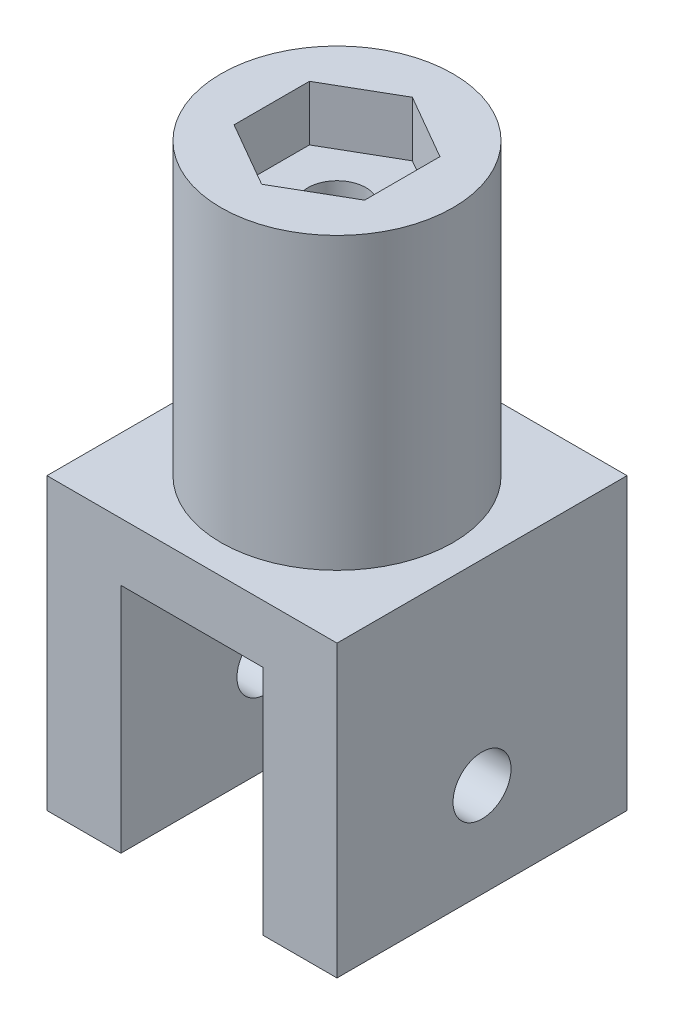
ISO-10303-21;
HEADER;
FILE_DESCRIPTION(('STEP AP214'),'2;1');
FILE_NAME('part.step','',(''),(''),'','','');
FILE_SCHEMA(('AUTOMOTIVE_DESIGN { 1 0 10303 214 1 1 1 1 }'));
ENDSEC;
DATA;
#1=APPLICATION_CONTEXT('core data for automotive mechanical design processes');
#2=APPLICATION_PROTOCOL_DEFINITION('international standard','automotive_design',2000,#1);
#3=PRODUCT_CONTEXT('',#1,'mechanical');
#4=PRODUCT('Part','Part','',(#3));
#5=PRODUCT_RELATED_PRODUCT_CATEGORY('part','',(#4));
#6=PRODUCT_DEFINITION_FORMATION('','',#4);
#7=PRODUCT_DEFINITION_CONTEXT('part definition',#1,'design');
#8=PRODUCT_DEFINITION('design','',#6,#7);
#9=PRODUCT_DEFINITION_SHAPE('','',#8);
#10=(LENGTH_UNIT() NAMED_UNIT(*) SI_UNIT(.MILLI.,.METRE.));
#11=(NAMED_UNIT(*) PLANE_ANGLE_UNIT() SI_UNIT($,.RADIAN.));
#12=(NAMED_UNIT(*) SI_UNIT($,.STERADIAN.) SOLID_ANGLE_UNIT());
#13=UNCERTAINTY_MEASURE_WITH_UNIT(LENGTH_MEASURE(1.E-05),#10,'distance_accuracy_value','');
#14=(GEOMETRIC_REPRESENTATION_CONTEXT(3) GLOBAL_UNCERTAINTY_ASSIGNED_CONTEXT((#13)) GLOBAL_UNIT_ASSIGNED_CONTEXT((#10,
#11,#12)) REPRESENTATION_CONTEXT('',''));
#15=CARTESIAN_POINT('',(0.,0.,0.));
#16=DIRECTION('',(0.,0.,1.));
#17=DIRECTION('',(1.,0.,0.));
#18=AXIS2_PLACEMENT_3D('',#15,#16,#17);
#19=CARTESIAN_POINT('',(0.,20.,0.));
#20=DIRECTION('',(0.,1.,0.));
#21=DIRECTION('',(0.,0.,1.));
#22=AXIS2_PLACEMENT_3D('',#19,#20,#21);
#23=PLANE('',#22);
#24=DIRECTION('',(0.,0.,-1.));
#25=VECTOR('',#24,1.);
#26=CARTESIAN_POINT('',(4.5,20.,2.59807621135332));
#27=LINE('',#26,#25);
#28=CARTESIAN_POINT('',(4.5,20.,2.59807621135332));
#29=VERTEX_POINT('',#28);
#30=CARTESIAN_POINT('',(4.5,20.,-2.59807621135332));
#31=VERTEX_POINT('',#30);
#32=EDGE_CURVE('E48',#29,#31,#27,.T.);
#33=ORIENTED_EDGE('',*,*,#32,.F.);
#34=DIRECTION('',(0.866025403784439,0.,-0.5));
#35=VECTOR('',#34,1.);
#36=CARTESIAN_POINT('',(0.,20.,5.19615242270663));
#37=LINE('',#36,#35);
#38=CARTESIAN_POINT('',(0.,20.,5.19615242270663));
#39=VERTEX_POINT('',#38);
#40=EDGE_CURVE('E156',#39,#29,#37,.T.);
#41=ORIENTED_EDGE('',*,*,#40,.F.);
#42=DIRECTION('',(0.866025403784439,0.,0.5));
#43=VECTOR('',#42,1.);
#44=CARTESIAN_POINT('',(-4.5,20.,2.59807621135332));
#45=LINE('',#44,#43);
#46=CARTESIAN_POINT('',(-4.5,20.,2.59807621135332));
#47=VERTEX_POINT('',#46);
#48=EDGE_CURVE('E159',#47,#39,#45,.T.);
#49=ORIENTED_EDGE('',*,*,#48,.F.);
#50=DIRECTION('',(0.,0.,1.));
#51=VECTOR('',#50,1.);
#52=CARTESIAN_POINT('',(-4.5,20.,-2.59807621135332));
#53=LINE('',#52,#51);
#54=CARTESIAN_POINT('',(-4.5,20.,-2.59807621135332));
#55=VERTEX_POINT('',#54);
#56=EDGE_CURVE('E175',#55,#47,#53,.T.);
#57=ORIENTED_EDGE('',*,*,#56,.F.);
#58=DIRECTION('',(-0.866025403784439,0.,0.5));
#59=VECTOR('',#58,1.);
#60=CARTESIAN_POINT('',(0.,20.,-5.19615242270663));
#61=LINE('',#60,#59);
#62=CARTESIAN_POINT('',(0.,20.,-5.19615242270663));
#63=VERTEX_POINT('',#62);
#64=EDGE_CURVE('E172',#63,#55,#61,.T.);
#65=ORIENTED_EDGE('',*,*,#64,.F.);
#66=DIRECTION('',(-0.866025403784439,0.,-0.5));
#67=VECTOR('',#66,1.);
#68=CARTESIAN_POINT('',(4.5,20.,-2.59807621135332));
#69=LINE('',#68,#67);
#70=EDGE_CURVE('E170',#31,#63,#69,.T.);
#71=ORIENTED_EDGE('',*,*,#70,.F.);
#72=EDGE_LOOP('',(#33,#41,#49,#57,#65,#71));
#73=FACE_BOUND('',#72,.T.);
#74=CARTESIAN_POINT('',(0.,20.,0.));
#75=DIRECTION('',(0.,1.,0.));
#76=DIRECTION('',(0.,0.,1.));
#77=AXIS2_PLACEMENT_3D('',#74,#75,#76);
#78=CIRCLE('',#77,8.);
#79=CARTESIAN_POINT('',(0.,20.,8.));
#80=VERTEX_POINT('',#79);
#81=EDGE_CURVE('E189',#80,#80,#78,.T.);
#82=ORIENTED_EDGE('',*,*,#81,.T.);
#83=EDGE_LOOP('',(#82));
#84=FACE_BOUND('',#83,.T.);
#85=ADVANCED_FACE('F33',(#73,#84),#23,.T.);
#86=CARTESIAN_POINT('',(0.,42.6274169979695,0.));
#87=DIRECTION('',(0.,-1.,0.));
#88=DIRECTION('',(0.,0.,-1.));
#89=AXIS2_PLACEMENT_3D('',#86,#87,#88);
#90=CYLINDRICAL_SURFACE('',#89,8.);
#91=CARTESIAN_POINT('',(0.,0.,0.));
#92=DIRECTION('',(0.,-1.,0.));
#93=DIRECTION('',(0.,0.,-1.));
#94=AXIS2_PLACEMENT_3D('',#91,#92,#93);
#95=CIRCLE('',#94,8.);
#96=CARTESIAN_POINT('',(0.,0.,-8.));
#97=VERTEX_POINT('',#96);
#98=EDGE_CURVE('E11',#97,#97,#95,.F.);
#99=ORIENTED_EDGE('',*,*,#98,.T.);
#100=EDGE_LOOP('',(#99));
#101=FACE_BOUND('',#100,.T.);
#102=ORIENTED_EDGE('',*,*,#81,.F.);
#103=EDGE_LOOP('',(#102));
#104=FACE_BOUND('',#103,.T.);
#105=ADVANCED_FACE('F296',(#101,#104),#90,.T.);
#106=CARTESIAN_POINT('',(-10.,-13.5,0.));
#107=DIRECTION('',(1.,0.,0.));
#108=DIRECTION('',(0.,0.,-1.));
#109=AXIS2_PLACEMENT_3D('',#106,#107,#108);
#110=CYLINDRICAL_SURFACE('',#109,2.);
#111=CARTESIAN_POINT('',(-4.9,-13.5,0.));
#112=DIRECTION('',(1.,0.,0.));
#113=DIRECTION('',(0.,0.,-1.));
#114=AXIS2_PLACEMENT_3D('',#111,#112,#113);
#115=CIRCLE('',#114,2.);
#116=CARTESIAN_POINT('',(-4.9,-13.5,-2.));
#117=VERTEX_POINT('',#116);
#118=EDGE_CURVE('E196',#117,#117,#115,.T.);
#119=ORIENTED_EDGE('',*,*,#118,.T.);
#120=EDGE_LOOP('',(#119));
#121=FACE_BOUND('',#120,.T.);
#122=CARTESIAN_POINT('',(-10.,-13.5,0.));
#123=DIRECTION('',(1.,0.,0.));
#124=DIRECTION('',(0.,0.,-1.));
#125=AXIS2_PLACEMENT_3D('',#122,#123,#124);
#126=CIRCLE('',#125,2.);
#127=CARTESIAN_POINT('',(-10.,-13.5,-2.));
#128=VERTEX_POINT('',#127);
#129=EDGE_CURVE('E193',#128,#128,#126,.T.);
#130=ORIENTED_EDGE('',*,*,#129,.F.);
#131=EDGE_LOOP('',(#130));
#132=FACE_BOUND('',#131,.T.);
#133=ADVANCED_FACE('F267',(#121,#132),#110,.F.);
#134=CARTESIAN_POINT('',(4.9,0.,-30.6400096899202));
#135=DIRECTION('',(-1.,0.,0.));
#136=DIRECTION('',(0.,0.,1.));
#137=AXIS2_PLACEMENT_3D('',#134,#135,#136);
#138=PLANE('',#137);
#139=CARTESIAN_POINT('',(4.9,-13.5,0.));
#140=DIRECTION('',(-1.,0.,0.));
#141=DIRECTION('',(0.,0.,1.));
#142=AXIS2_PLACEMENT_3D('',#139,#140,#141);
#143=CIRCLE('',#142,2.);
#144=CARTESIAN_POINT('',(4.9,-13.5,2.));
#145=VERTEX_POINT('',#144);
#146=EDGE_CURVE('E199',#145,#145,#143,.T.);
#147=ORIENTED_EDGE('',*,*,#146,.F.);
#148=EDGE_LOOP('',(#147));
#149=FACE_BOUND('',#148,.T.);
#150=DIRECTION('',(0.,-1.,0.));
#151=VECTOR('',#150,1.);
#152=CARTESIAN_POINT('',(4.9,0.,10.));
#153=LINE('',#152,#151);
#154=CARTESIAN_POINT('',(4.9,-4.,10.));
#155=VERTEX_POINT('',#154);
#156=CARTESIAN_POINT('',(4.9,-20.,10.));
#157=VERTEX_POINT('',#156);
#158=EDGE_CURVE('E220',#155,#157,#153,.T.);
#159=ORIENTED_EDGE('',*,*,#158,.F.);
#160=DIRECTION('',(0.,0.,-1.));
#161=VECTOR('',#160,1.);
#162=CARTESIAN_POINT('',(4.9,-4.,0.));
#163=LINE('',#162,#161);
#164=CARTESIAN_POINT('',(4.9,-4.,-10.));
#165=VERTEX_POINT('',#164);
#166=EDGE_CURVE('E227',#155,#165,#163,.T.);
#167=ORIENTED_EDGE('',*,*,#166,.T.);
#168=DIRECTION('',(0.,1.,0.));
#169=VECTOR('',#168,1.);
#170=CARTESIAN_POINT('',(4.9,0.,-10.));
#171=LINE('',#170,#169);
#172=CARTESIAN_POINT('',(4.9,-20.,-10.));
#173=VERTEX_POINT('',#172);
#174=EDGE_CURVE('E221',#173,#165,#171,.T.);
#175=ORIENTED_EDGE('',*,*,#174,.F.);
#176=DIRECTION('',(0.,0.,1.));
#177=VECTOR('',#176,1.);
#178=CARTESIAN_POINT('',(4.9,-20.,-30.6400096899202));
#179=LINE('',#178,#177);
#180=EDGE_CURVE('E232',#173,#157,#179,.T.);
#181=ORIENTED_EDGE('',*,*,#180,.T.);
#182=EDGE_LOOP('',(#159,#167,#175,#181));
#183=FACE_BOUND('',#182,.T.);
#184=ADVANCED_FACE('F338',(#149,#183),#138,.T.);
#185=CARTESIAN_POINT('',(-10.,-20.,-30.6400096899202));
#186=DIRECTION('',(0.,-1.,0.));
#187=DIRECTION('',(0.,0.,-1.));
#188=AXIS2_PLACEMENT_3D('',#185,#186,#187);
#189=PLANE('',#188);
#190=DIRECTION('',(-1.,0.,0.));
#191=VECTOR('',#190,1.);
#192=CARTESIAN_POINT('',(-10.,-20.,-10.));
#193=LINE('',#192,#191);
#194=CARTESIAN_POINT('',(-4.9,-20.,-10.));
#195=VERTEX_POINT('',#194);
#196=CARTESIAN_POINT('',(-10.,-20.,-10.));
#197=VERTEX_POINT('',#196);
#198=EDGE_CURVE('E205',#195,#197,#193,.T.);
#199=ORIENTED_EDGE('',*,*,#198,.F.);
#200=DIRECTION('',(0.,0.,1.));
#201=VECTOR('',#200,1.);
#202=CARTESIAN_POINT('',(-4.9,-20.,-30.6400096899202));
#203=LINE('',#202,#201);
#204=CARTESIAN_POINT('',(-4.9,-20.,10.));
#205=VERTEX_POINT('',#204);
#206=EDGE_CURVE('E206',#195,#205,#203,.T.);
#207=ORIENTED_EDGE('',*,*,#206,.T.);
#208=DIRECTION('',(1.,0.,0.));
#209=VECTOR('',#208,1.);
#210=CARTESIAN_POINT('',(-10.,-20.,10.));
#211=LINE('',#210,#209);
#212=CARTESIAN_POINT('',(-10.,-20.,10.));
#213=VERTEX_POINT('',#212);
#214=EDGE_CURVE('E202',#213,#205,#211,.T.);
#215=ORIENTED_EDGE('',*,*,#214,.F.);
#216=DIRECTION('',(0.,0.,1.));
#217=VECTOR('',#216,1.);
#218=CARTESIAN_POINT('',(-10.,-20.,-30.6400096899202));
#219=LINE('',#218,#217);
#220=EDGE_CURVE('E212',#197,#213,#219,.T.);
#221=ORIENTED_EDGE('',*,*,#220,.F.);
#222=EDGE_LOOP('',(#199,#207,#215,#221));
#223=FACE_BOUND('',#222,.T.);
#224=ADVANCED_FACE('F274',(#223),#189,.T.);
#225=CARTESIAN_POINT('',(-4.9,0.,-30.6400096899202));
#226=DIRECTION('',(1.,0.,0.));
#227=DIRECTION('',(0.,0.,-1.));
#228=AXIS2_PLACEMENT_3D('',#225,#226,#227);
#229=PLANE('',#228);
#230=ORIENTED_EDGE('',*,*,#118,.F.);
#231=EDGE_LOOP('',(#230));
#232=FACE_BOUND('',#231,.T.);
#233=DIRECTION('',(0.,-1.,0.));
#234=VECTOR('',#233,1.);
#235=CARTESIAN_POINT('',(-4.9,0.,-10.));
#236=LINE('',#235,#234);
#237=CARTESIAN_POINT('',(-4.9,-4.,-10.));
#238=VERTEX_POINT('',#237);
#239=EDGE_CURVE('E203',#238,#195,#236,.T.);
#240=ORIENTED_EDGE('',*,*,#239,.F.);
#241=DIRECTION('',(0.,0.,1.));
#242=VECTOR('',#241,1.);
#243=CARTESIAN_POINT('',(-4.9,-4.,0.));
#244=LINE('',#243,#242);
#245=CARTESIAN_POINT('',(-4.9,-4.,10.));
#246=VERTEX_POINT('',#245);
#247=EDGE_CURVE('E218',#238,#246,#244,.T.);
#248=ORIENTED_EDGE('',*,*,#247,.T.);
#249=DIRECTION('',(0.,1.,0.));
#250=VECTOR('',#249,1.);
#251=CARTESIAN_POINT('',(-4.9,0.,10.));
#252=LINE('',#251,#250);
#253=EDGE_CURVE('E209',#205,#246,#252,.T.);
#254=ORIENTED_EDGE('',*,*,#253,.F.);
#255=ORIENTED_EDGE('',*,*,#206,.F.);
#256=EDGE_LOOP('',(#240,#248,#254,#255));
#257=FACE_BOUND('',#256,.T.);
#258=ADVANCED_FACE('F270',(#232,#257),#229,.T.);
#259=CARTESIAN_POINT('',(0.,-4.,0.));
#260=DIRECTION('',(0.,-1.,0.));
#261=DIRECTION('',(0.,0.,-1.));
#262=AXIS2_PLACEMENT_3D('',#259,#260,#261);
#263=PLANE('',#262);
#264=ORIENTED_EDGE('',*,*,#247,.F.);
#265=DIRECTION('',(1.,0.,0.));
#266=VECTOR('',#265,1.);
#267=CARTESIAN_POINT('',(-10.,-4.,-10.));
#268=LINE('',#267,#266);
#269=EDGE_CURVE('E241',#238,#165,#268,.T.);
#270=ORIENTED_EDGE('',*,*,#269,.T.);
#271=ORIENTED_EDGE('',*,*,#166,.F.);
#272=DIRECTION('',(-1.,0.,0.));
#273=VECTOR('',#272,1.);
#274=CARTESIAN_POINT('',(-10.,-4.,10.));
#275=LINE('',#274,#273);
#276=EDGE_CURVE('E56',#155,#246,#275,.T.);
#277=ORIENTED_EDGE('',*,*,#276,.T.);
#278=EDGE_LOOP('',(#264,#270,#271,#277));
#279=FACE_BOUND('',#278,.T.);
#280=ADVANCED_FACE('F273',(#279),#263,.T.);
#281=CARTESIAN_POINT('',(10.,-20.,-30.6400096899202));
#282=DIRECTION('',(0.,-1.,0.));
#283=DIRECTION('',(0.,0.,-1.));
#284=AXIS2_PLACEMENT_3D('',#281,#282,#283);
#285=PLANE('',#284);
#286=DIRECTION('',(-1.,0.,0.));
#287=VECTOR('',#286,1.);
#288=CARTESIAN_POINT('',(10.,-20.,-10.));
#289=LINE('',#288,#287);
#290=CARTESIAN_POINT('',(10.,-20.,-10.));
#291=VERTEX_POINT('',#290);
#292=EDGE_CURVE('E224',#291,#173,#289,.T.);
#293=ORIENTED_EDGE('',*,*,#292,.F.);
#294=DIRECTION('',(0.,0.,1.));
#295=VECTOR('',#294,1.);
#296=CARTESIAN_POINT('',(10.,-20.,-30.6400096899202));
#297=LINE('',#296,#295);
#298=CARTESIAN_POINT('',(10.,-20.,10.));
#299=VERTEX_POINT('',#298);
#300=EDGE_CURVE('E225',#291,#299,#297,.T.);
#301=ORIENTED_EDGE('',*,*,#300,.T.);
#302=DIRECTION('',(1.,0.,0.));
#303=VECTOR('',#302,1.);
#304=CARTESIAN_POINT('',(10.,-20.,10.));
#305=LINE('',#304,#303);
#306=EDGE_CURVE('E229',#157,#299,#305,.T.);
#307=ORIENTED_EDGE('',*,*,#306,.F.);
#308=ORIENTED_EDGE('',*,*,#180,.F.);
#309=EDGE_LOOP('',(#293,#301,#307,#308));
#310=FACE_BOUND('',#309,.T.);
#311=ADVANCED_FACE('F285',(#310),#285,.T.);
#312=ORIENTED_EDGE('',*,*,#146,.T.);
#313=EDGE_LOOP('',(#312));
#314=FACE_BOUND('',#313,.T.);
#315=CARTESIAN_POINT('',(10.,-13.5,0.));
#316=DIRECTION('',(1.,0.,0.));
#317=DIRECTION('',(0.,0.,-1.));
#318=AXIS2_PLACEMENT_3D('',#315,#316,#317);
#319=CIRCLE('',#318,2.);
#320=CARTESIAN_POINT('',(10.,-13.5,-2.));
#321=VERTEX_POINT('',#320);
#322=EDGE_CURVE('E192',#321,#321,#319,.T.);
#323=ORIENTED_EDGE('',*,*,#322,.T.);
#324=EDGE_LOOP('',(#323));
#325=FACE_BOUND('',#324,.T.);
#326=ADVANCED_FACE('F290',(#314,#325),#110,.F.);
#327=CARTESIAN_POINT('',(-10.,-4.,10.));
#328=DIRECTION('',(0.,0.,-1.));
#329=DIRECTION('',(-1.,0.,0.));
#330=AXIS2_PLACEMENT_3D('',#327,#328,#329);
#331=PLANE('',#330);
#332=DIRECTION('',(-1.,0.,0.));
#333=VECTOR('',#332,1.);
#334=CARTESIAN_POINT('',(-10.,0.,10.));
#335=LINE('',#334,#333);
#336=CARTESIAN_POINT('',(10.,0.,10.));
#337=VERTEX_POINT('',#336);
#338=CARTESIAN_POINT('',(-10.,0.,10.));
#339=VERTEX_POINT('',#338);
#340=EDGE_CURVE('E239',#337,#339,#335,.T.);
#341=ORIENTED_EDGE('',*,*,#340,.T.);
#342=DIRECTION('',(0.,1.,0.));
#343=VECTOR('',#342,1.);
#344=CARTESIAN_POINT('',(-10.,-4.,10.));
#345=LINE('',#344,#343);
#346=EDGE_CURVE('E259',#213,#339,#345,.T.);
#347=ORIENTED_EDGE('',*,*,#346,.F.);
#348=ORIENTED_EDGE('',*,*,#214,.T.);
#349=ORIENTED_EDGE('',*,*,#253,.T.);
#350=ORIENTED_EDGE('',*,*,#276,.F.);
#351=ORIENTED_EDGE('',*,*,#158,.T.);
#352=ORIENTED_EDGE('',*,*,#306,.T.);
#353=DIRECTION('',(0.,1.,0.));
#354=VECTOR('',#353,1.);
#355=CARTESIAN_POINT('',(10.,-4.,10.));
#356=LINE('',#355,#354);
#357=EDGE_CURVE('E244',#299,#337,#356,.T.);
#358=ORIENTED_EDGE('',*,*,#357,.T.);
#359=EDGE_LOOP('',(#341,#347,#348,#349,#350,#351,#352,#358));
#360=FACE_BOUND('',#359,.T.);
#361=ADVANCED_FACE('F352',(#360),#331,.F.);
#362=CARTESIAN_POINT('',(-10.,-4.,10.));
#363=DIRECTION('',(1.,0.,0.));
#364=DIRECTION('',(0.,0.,-1.));
#365=AXIS2_PLACEMENT_3D('',#362,#363,#364);
#366=PLANE('',#365);
#367=ORIENTED_EDGE('',*,*,#129,.T.);
#368=EDGE_LOOP('',(#367));
#369=FACE_BOUND('',#368,.T.);
#370=DIRECTION('',(0.,0.,-1.));
#371=VECTOR('',#370,1.);
#372=CARTESIAN_POINT('',(-10.,0.,10.));
#373=LINE('',#372,#371);
#374=CARTESIAN_POINT('',(-10.,0.,-10.));
#375=VERTEX_POINT('',#374);
#376=EDGE_CURVE('E246',#339,#375,#373,.T.);
#377=ORIENTED_EDGE('',*,*,#376,.T.);
#378=DIRECTION('',(0.,1.,0.));
#379=VECTOR('',#378,1.);
#380=CARTESIAN_POINT('',(-10.,-4.,-10.));
#381=LINE('',#380,#379);
#382=EDGE_CURVE('E256',#197,#375,#381,.T.);
#383=ORIENTED_EDGE('',*,*,#382,.F.);
#384=ORIENTED_EDGE('',*,*,#220,.T.);
#385=ORIENTED_EDGE('',*,*,#346,.T.);
#386=EDGE_LOOP('',(#377,#383,#384,#385));
#387=FACE_BOUND('',#386,.T.);
#388=ADVANCED_FACE('F355',(#369,#387),#366,.F.);
#389=CARTESIAN_POINT('',(-10.,-4.,-10.));
#390=DIRECTION('',(0.,0.,1.));
#391=DIRECTION('',(1.,0.,0.));
#392=AXIS2_PLACEMENT_3D('',#389,#390,#391);
#393=PLANE('',#392);
#394=ORIENTED_EDGE('',*,*,#269,.F.);
#395=ORIENTED_EDGE('',*,*,#239,.T.);
#396=ORIENTED_EDGE('',*,*,#198,.T.);
#397=ORIENTED_EDGE('',*,*,#382,.T.);
#398=DIRECTION('',(1.,0.,0.));
#399=VECTOR('',#398,1.);
#400=CARTESIAN_POINT('',(-10.,0.,-10.));
#401=LINE('',#400,#399);
#402=CARTESIAN_POINT('',(10.,0.,-10.));
#403=VERTEX_POINT('',#402);
#404=EDGE_CURVE('E248',#375,#403,#401,.T.);
#405=ORIENTED_EDGE('',*,*,#404,.T.);
#406=DIRECTION('',(0.,1.,0.));
#407=VECTOR('',#406,1.);
#408=CARTESIAN_POINT('',(10.,-4.,-10.));
#409=LINE('',#408,#407);
#410=EDGE_CURVE('E253',#291,#403,#409,.T.);
#411=ORIENTED_EDGE('',*,*,#410,.F.);
#412=ORIENTED_EDGE('',*,*,#292,.T.);
#413=ORIENTED_EDGE('',*,*,#174,.T.);
#414=EDGE_LOOP('',(#394,#395,#396,#397,#405,#411,#412,#413));
#415=FACE_BOUND('',#414,.T.);
#416=ADVANCED_FACE('F281',(#415),#393,.F.);
#417=CARTESIAN_POINT('',(10.,-4.,-10.));
#418=DIRECTION('',(-1.,0.,0.));
#419=DIRECTION('',(0.,0.,1.));
#420=AXIS2_PLACEMENT_3D('',#417,#418,#419);
#421=PLANE('',#420);
#422=ORIENTED_EDGE('',*,*,#322,.F.);
#423=EDGE_LOOP('',(#422));
#424=FACE_BOUND('',#423,.T.);
#425=DIRECTION('',(0.,0.,1.));
#426=VECTOR('',#425,1.);
#427=CARTESIAN_POINT('',(10.,0.,-10.));
#428=LINE('',#427,#426);
#429=EDGE_CURVE('E242',#403,#337,#428,.T.);
#430=ORIENTED_EDGE('',*,*,#429,.T.);
#431=ORIENTED_EDGE('',*,*,#357,.F.);
#432=ORIENTED_EDGE('',*,*,#300,.F.);
#433=ORIENTED_EDGE('',*,*,#410,.T.);
#434=EDGE_LOOP('',(#430,#431,#432,#433));
#435=FACE_BOUND('',#434,.T.);
#436=ADVANCED_FACE('F363',(#424,#435),#421,.F.);
#437=CARTESIAN_POINT('',(0.,0.,0.));
#438=DIRECTION('',(0.,-1.,0.));
#439=DIRECTION('',(0.,0.,-1.));
#440=AXIS2_PLACEMENT_3D('',#437,#438,#439);
#441=PLANE('',#440);
#442=ORIENTED_EDGE('',*,*,#429,.F.);
#443=ORIENTED_EDGE('',*,*,#404,.F.);
#444=ORIENTED_EDGE('',*,*,#376,.F.);
#445=ORIENTED_EDGE('',*,*,#340,.F.);
#446=EDGE_LOOP('',(#442,#443,#444,#445));
#447=FACE_BOUND('',#446,.T.);
#448=ORIENTED_EDGE('',*,*,#98,.F.);
#449=EDGE_LOOP('',(#448));
#450=FACE_BOUND('',#449,.T.);
#451=ADVANCED_FACE('F327',(#447,#450),#441,.F.);
#452=CARTESIAN_POINT('',(4.5,16.2,2.59807621135332));
#453=DIRECTION('',(1.,0.,0.));
#454=DIRECTION('',(0.,0.,-1.));
#455=AXIS2_PLACEMENT_3D('',#452,#453,#454);
#456=PLANE('',#455);
#457=ORIENTED_EDGE('',*,*,#32,.T.);
#458=DIRECTION('',(0.,1.,0.));
#459=VECTOR('',#458,1.);
#460=CARTESIAN_POINT('',(4.5,16.2,-2.59807621135332));
#461=LINE('',#460,#459);
#462=CARTESIAN_POINT('',(4.5,16.2,-2.59807621135332));
#463=VERTEX_POINT('',#462);
#464=EDGE_CURVE('E133',#463,#31,#461,.T.);
#465=ORIENTED_EDGE('',*,*,#464,.F.);
#466=DIRECTION('',(0.,0.,-1.));
#467=VECTOR('',#466,1.);
#468=CARTESIAN_POINT('',(4.5,16.2,2.59807621135332));
#469=LINE('',#468,#467);
#470=CARTESIAN_POINT('',(4.5,16.2,2.59807621135332));
#471=VERTEX_POINT('',#470);
#472=EDGE_CURVE('E137',#471,#463,#469,.T.);
#473=ORIENTED_EDGE('',*,*,#472,.F.);
#474=DIRECTION('',(0.,1.,0.));
#475=VECTOR('',#474,1.);
#476=CARTESIAN_POINT('',(4.5,16.2,2.59807621135332));
#477=LINE('',#476,#475);
#478=EDGE_CURVE('E180',#471,#29,#477,.T.);
#479=ORIENTED_EDGE('',*,*,#478,.T.);
#480=EDGE_LOOP('',(#457,#465,#473,#479));
#481=FACE_BOUND('',#480,.T.);
#482=ADVANCED_FACE('F135',(#481),#456,.F.);
#483=CARTESIAN_POINT('',(0.,16.2,5.19615242270663));
#484=DIRECTION('',(0.5,0.,0.866025403784439));
#485=DIRECTION('',(0.866025403784439,0.,-0.5));
#486=AXIS2_PLACEMENT_3D('',#483,#484,#485);
#487=PLANE('',#486);
#488=ORIENTED_EDGE('',*,*,#40,.T.);
#489=ORIENTED_EDGE('',*,*,#478,.F.);
#490=DIRECTION('',(0.866025403784439,0.,-0.5));
#491=VECTOR('',#490,1.);
#492=CARTESIAN_POINT('',(0.,16.2,5.19615242270663));
#493=LINE('',#492,#491);
#494=CARTESIAN_POINT('',(0.,16.2,5.19615242270663));
#495=VERTEX_POINT('',#494);
#496=EDGE_CURVE('E143',#495,#471,#493,.T.);
#497=ORIENTED_EDGE('',*,*,#496,.F.);
#498=DIRECTION('',(0.,1.,0.));
#499=VECTOR('',#498,1.);
#500=CARTESIAN_POINT('',(0.,16.2,5.19615242270663));
#501=LINE('',#500,#499);
#502=EDGE_CURVE('E182',#495,#39,#501,.T.);
#503=ORIENTED_EDGE('',*,*,#502,.T.);
#504=EDGE_LOOP('',(#488,#489,#497,#503));
#505=FACE_BOUND('',#504,.T.);
#506=ADVANCED_FACE('F319',(#505),#487,.F.);
#507=CARTESIAN_POINT('',(-4.5,16.2,2.59807621135332));
#508=DIRECTION('',(-0.5,0.,0.866025403784439));
#509=DIRECTION('',(0.866025403784439,0.,0.5));
#510=AXIS2_PLACEMENT_3D('',#507,#508,#509);
#511=PLANE('',#510);
#512=ORIENTED_EDGE('',*,*,#48,.T.);
#513=ORIENTED_EDGE('',*,*,#502,.F.);
#514=DIRECTION('',(0.866025403784439,0.,0.5));
#515=VECTOR('',#514,1.);
#516=CARTESIAN_POINT('',(-4.5,16.2,2.59807621135332));
#517=LINE('',#516,#515);
#518=CARTESIAN_POINT('',(-4.5,16.2,2.59807621135332));
#519=VERTEX_POINT('',#518);
#520=EDGE_CURVE('E166',#519,#495,#517,.T.);
#521=ORIENTED_EDGE('',*,*,#520,.F.);
#522=DIRECTION('',(0.,1.,0.));
#523=VECTOR('',#522,1.);
#524=CARTESIAN_POINT('',(-4.5,16.2,2.59807621135332));
#525=LINE('',#524,#523);
#526=EDGE_CURVE('E184',#519,#47,#525,.T.);
#527=ORIENTED_EDGE('',*,*,#526,.T.);
#528=EDGE_LOOP('',(#512,#513,#521,#527));
#529=FACE_BOUND('',#528,.T.);
#530=ADVANCED_FACE('F317',(#529),#511,.F.);
#531=CARTESIAN_POINT('',(-4.5,16.2,-2.59807621135332));
#532=DIRECTION('',(-1.,0.,0.));
#533=DIRECTION('',(0.,0.,1.));
#534=AXIS2_PLACEMENT_3D('',#531,#532,#533);
#535=PLANE('',#534);
#536=ORIENTED_EDGE('',*,*,#56,.T.);
#537=ORIENTED_EDGE('',*,*,#526,.F.);
#538=DIRECTION('',(0.,0.,1.));
#539=VECTOR('',#538,1.);
#540=CARTESIAN_POINT('',(-4.5,16.2,-2.59807621135332));
#541=LINE('',#540,#539);
#542=CARTESIAN_POINT('',(-4.5,16.2,-2.59807621135332));
#543=VERTEX_POINT('',#542);
#544=EDGE_CURVE('E163',#543,#519,#541,.T.);
#545=ORIENTED_EDGE('',*,*,#544,.F.);
#546=DIRECTION('',(0.,1.,0.));
#547=VECTOR('',#546,1.);
#548=CARTESIAN_POINT('',(-4.5,16.2,-2.59807621135332));
#549=LINE('',#548,#547);
#550=EDGE_CURVE('E186',#543,#55,#549,.T.);
#551=ORIENTED_EDGE('',*,*,#550,.T.);
#552=EDGE_LOOP('',(#536,#537,#545,#551));
#553=FACE_BOUND('',#552,.T.);
#554=ADVANCED_FACE('F315',(#553),#535,.F.);
#555=CARTESIAN_POINT('',(0.,16.2,-5.19615242270663));
#556=DIRECTION('',(-0.5,0.,-0.866025403784439));
#557=DIRECTION('',(-0.866025403784439,0.,0.5));
#558=AXIS2_PLACEMENT_3D('',#555,#556,#557);
#559=PLANE('',#558);
#560=ORIENTED_EDGE('',*,*,#64,.T.);
#561=ORIENTED_EDGE('',*,*,#550,.F.);
#562=DIRECTION('',(-0.866025403784439,0.,0.5));
#563=VECTOR('',#562,1.);
#564=CARTESIAN_POINT('',(0.,16.2,-5.19615242270663));
#565=LINE('',#564,#563);
#566=CARTESIAN_POINT('',(0.,16.2,-5.19615242270663));
#567=VERTEX_POINT('',#566);
#568=EDGE_CURVE('E151',#567,#543,#565,.T.);
#569=ORIENTED_EDGE('',*,*,#568,.F.);
#570=DIRECTION('',(0.,1.,0.));
#571=VECTOR('',#570,1.);
#572=CARTESIAN_POINT('',(0.,16.2,-5.19615242270663));
#573=LINE('',#572,#571);
#574=EDGE_CURVE('E142',#567,#63,#573,.T.);
#575=ORIENTED_EDGE('',*,*,#574,.T.);
#576=EDGE_LOOP('',(#560,#561,#569,#575));
#577=FACE_BOUND('',#576,.T.);
#578=ADVANCED_FACE('F311',(#577),#559,.F.);
#579=CARTESIAN_POINT('',(4.5,16.2,-2.59807621135332));
#580=DIRECTION('',(0.5,0.,-0.866025403784439));
#581=DIRECTION('',(-0.866025403784439,0.,-0.5));
#582=AXIS2_PLACEMENT_3D('',#579,#580,#581);
#583=PLANE('',#582);
#584=ORIENTED_EDGE('',*,*,#70,.T.);
#585=ORIENTED_EDGE('',*,*,#574,.F.);
#586=DIRECTION('',(-0.866025403784439,0.,-0.5));
#587=VECTOR('',#586,1.);
#588=CARTESIAN_POINT('',(4.5,16.2,-2.59807621135332));
#589=LINE('',#588,#587);
#590=EDGE_CURVE('E146',#463,#567,#589,.T.);
#591=ORIENTED_EDGE('',*,*,#590,.F.);
#592=ORIENTED_EDGE('',*,*,#464,.T.);
#593=EDGE_LOOP('',(#584,#585,#591,#592));
#594=FACE_BOUND('',#593,.T.);
#595=ADVANCED_FACE('F147',(#594),#583,.F.);
#596=CARTESIAN_POINT('',(0.,16.2,0.));
#597=DIRECTION('',(0.,1.,0.));
#598=DIRECTION('',(0.,0.,1.));
#599=AXIS2_PLACEMENT_3D('',#596,#597,#598);
#600=PLANE('',#599);
#601=CARTESIAN_POINT('',(0.,16.2,0.));
#602=DIRECTION('',(0.,1.,0.));
#603=DIRECTION('',(0.,0.,1.));
#604=AXIS2_PLACEMENT_3D('',#601,#602,#603);
#605=CIRCLE('',#604,2.);
#606=CARTESIAN_POINT('',(0.,16.2,2.));
#607=VERTEX_POINT('',#606);
#608=EDGE_CURVE('E36',#607,#607,#605,.T.);
#609=ORIENTED_EDGE('',*,*,#608,.F.);
#610=EDGE_LOOP('',(#609));
#611=FACE_BOUND('',#610,.T.);
#612=ORIENTED_EDGE('',*,*,#472,.T.);
#613=ORIENTED_EDGE('',*,*,#590,.T.);
#614=ORIENTED_EDGE('',*,*,#568,.T.);
#615=ORIENTED_EDGE('',*,*,#544,.T.);
#616=ORIENTED_EDGE('',*,*,#520,.T.);
#617=ORIENTED_EDGE('',*,*,#496,.T.);
#618=EDGE_LOOP('',(#612,#613,#614,#615,#616,#617));
#619=FACE_BOUND('',#618,.T.);
#620=ADVANCED_FACE('F153',(#611,#619),#600,.T.);
#621=CARTESIAN_POINT('',(0.,0.,0.));
#622=DIRECTION('',(0.,1.,0.));
#623=DIRECTION('',(0.,0.,1.));
#624=AXIS2_PLACEMENT_3D('',#621,#622,#623);
#625=CIRCLE('',#624,2.);
#626=CARTESIAN_POINT('',(0.,0.,2.));
#627=VERTEX_POINT('',#626);
#628=EDGE_CURVE('E41',#627,#627,#625,.T.);
#629=ORIENTED_EDGE('',*,*,#628,.T.);
#630=EDGE_LOOP('',(#629));
#631=FACE_BOUND('',#630,.T.);
#632=ADVANCED_FACE('F373',(#631),#441,.F.);
#633=CARTESIAN_POINT('',(0.,20.,0.));
#634=DIRECTION('',(0.,-1.,0.));
#635=DIRECTION('',(0.,0.,-1.));
#636=AXIS2_PLACEMENT_3D('',#633,#634,#635);
#637=CYLINDRICAL_SURFACE('',#636,2.);
#638=ORIENTED_EDGE('',*,*,#628,.F.);
#639=EDGE_LOOP('',(#638));
#640=FACE_BOUND('',#639,.T.);
#641=ORIENTED_EDGE('',*,*,#608,.T.);
#642=EDGE_LOOP('',(#641));
#643=FACE_BOUND('',#642,.T.);
#644=ADVANCED_FACE('F381',(#640,#643),#637,.F.);
#645=CLOSED_SHELL('',(#85,#105,#133,#184,#224,#258,#280,#311,#326,#361,#388,#416,#436,#451,#482,
#506,#530,#554,#578,#595,#620,#632,#644));
#646=MANIFOLD_SOLID_BREP('B2',#645);
#647=ADVANCED_BREP_SHAPE_REPRESENTATION('',(#18,#646),#14);
#648=SHAPE_DEFINITION_REPRESENTATION(#9,#647);
ENDSEC;
END-ISO-10303-21;
